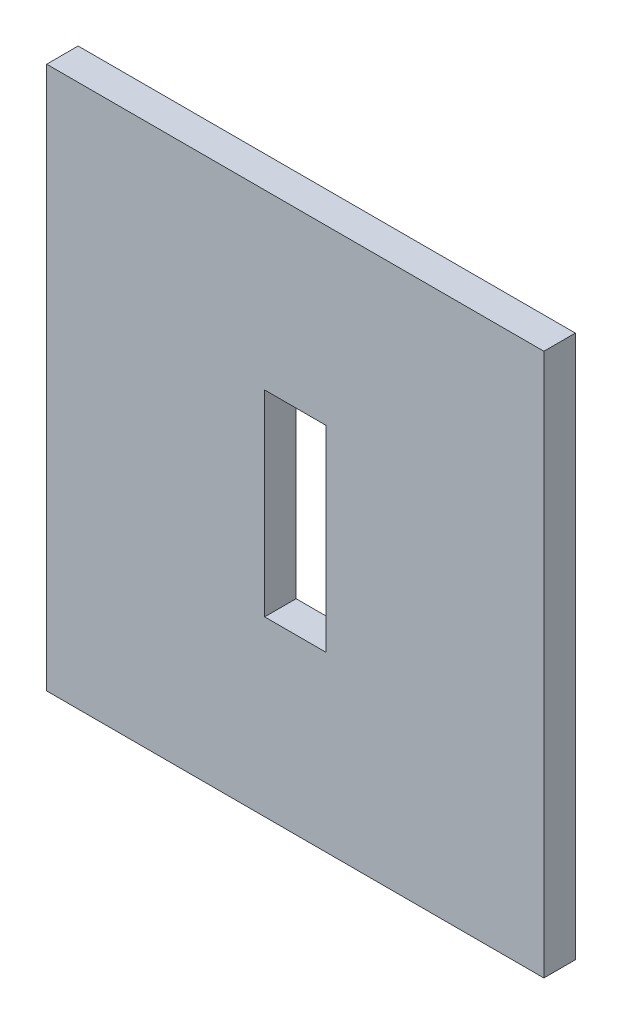
ISO-10303-21;
HEADER;
FILE_DESCRIPTION(('STEP AP214'),'2;1');
FILE_NAME('part.step','',(''),(''),'','','');
FILE_SCHEMA(('AUTOMOTIVE_DESIGN { 1 0 10303 214 1 1 1 1 }'));
ENDSEC;
DATA;
#1=APPLICATION_CONTEXT('core data for automotive mechanical design processes');
#2=APPLICATION_PROTOCOL_DEFINITION('international standard','automotive_design',2000,#1);
#3=PRODUCT_CONTEXT('',#1,'mechanical');
#4=PRODUCT('Part','Part','',(#3));
#5=PRODUCT_RELATED_PRODUCT_CATEGORY('part','',(#4));
#6=PRODUCT_DEFINITION_FORMATION('','',#4);
#7=PRODUCT_DEFINITION_CONTEXT('part definition',#1,'design');
#8=PRODUCT_DEFINITION('design','',#6,#7);
#9=PRODUCT_DEFINITION_SHAPE('','',#8);
#10=(LENGTH_UNIT() NAMED_UNIT(*) SI_UNIT(.MILLI.,.METRE.));
#11=(NAMED_UNIT(*) PLANE_ANGLE_UNIT() SI_UNIT($,.RADIAN.));
#12=(NAMED_UNIT(*) SI_UNIT($,.STERADIAN.) SOLID_ANGLE_UNIT());
#13=UNCERTAINTY_MEASURE_WITH_UNIT(LENGTH_MEASURE(1.E-05),#10,'distance_accuracy_value','');
#14=(GEOMETRIC_REPRESENTATION_CONTEXT(3) GLOBAL_UNCERTAINTY_ASSIGNED_CONTEXT((#13)) GLOBAL_UNIT_ASSIGNED_CONTEXT((#10,
#11,#12)) REPRESENTATION_CONTEXT('',''));
#15=CARTESIAN_POINT('',(0.,0.,0.));
#16=DIRECTION('',(0.,0.,1.));
#17=DIRECTION('',(1.,0.,0.));
#18=AXIS2_PLACEMENT_3D('',#15,#16,#17);
#19=CARTESIAN_POINT('',(25.085,27.385,3.175));
#20=DIRECTION('',(-1.,0.,0.));
#21=DIRECTION('',(0.,-1.,0.));
#22=AXIS2_PLACEMENT_3D('',#19,#20,#21);
#23=PLANE('',#22);
#24=DIRECTION('',(0.,1.,0.));
#25=VECTOR('',#24,1.);
#26=CARTESIAN_POINT('',(25.085,27.385,0.));
#27=LINE('',#26,#25);
#28=CARTESIAN_POINT('',(25.085,-27.385,0.));
#29=VERTEX_POINT('',#28);
#30=CARTESIAN_POINT('',(25.085,27.385,0.));
#31=VERTEX_POINT('',#30);
#32=EDGE_CURVE('E133',#29,#31,#27,.T.);
#33=ORIENTED_EDGE('',*,*,#32,.T.);
#34=DIRECTION('',(0.,0.,-1.));
#35=VECTOR('',#34,1.);
#36=CARTESIAN_POINT('',(25.085,27.385,3.175));
#37=LINE('',#36,#35);
#38=CARTESIAN_POINT('',(25.085,27.385,3.175));
#39=VERTEX_POINT('',#38);
#40=EDGE_CURVE('E11',#39,#31,#37,.T.);
#41=ORIENTED_EDGE('',*,*,#40,.F.);
#42=DIRECTION('',(0.,1.,0.));
#43=VECTOR('',#42,1.);
#44=CARTESIAN_POINT('',(25.085,27.385,3.175));
#45=LINE('',#44,#43);
#46=CARTESIAN_POINT('',(25.085,-27.385,3.175));
#47=VERTEX_POINT('',#46);
#48=EDGE_CURVE('E137',#47,#39,#45,.T.);
#49=ORIENTED_EDGE('',*,*,#48,.F.);
#50=DIRECTION('',(0.,0.,-1.));
#51=VECTOR('',#50,1.);
#52=CARTESIAN_POINT('',(25.085,-27.385,3.175));
#53=LINE('',#52,#51);
#54=EDGE_CURVE('E147',#47,#29,#53,.T.);
#55=ORIENTED_EDGE('',*,*,#54,.T.);
#56=EDGE_LOOP('',(#33,#41,#49,#55));
#57=FACE_BOUND('',#56,.T.);
#58=ADVANCED_FACE('F36',(#57),#23,.F.);
#59=CARTESIAN_POINT('',(-25.085,27.385,3.175));
#60=DIRECTION('',(0.,-1.,0.));
#61=DIRECTION('',(0.,0.,-1.));
#62=AXIS2_PLACEMENT_3D('',#59,#60,#61);
#63=PLANE('',#62);
#64=DIRECTION('',(-1.,0.,0.));
#65=VECTOR('',#64,1.);
#66=CARTESIAN_POINT('',(-25.085,27.385,0.));
#67=LINE('',#66,#65);
#68=CARTESIAN_POINT('',(-25.085,27.385,0.));
#69=VERTEX_POINT('',#68);
#70=EDGE_CURVE('E150',#31,#69,#67,.T.);
#71=ORIENTED_EDGE('',*,*,#70,.T.);
#72=DIRECTION('',(0.,0.,-1.));
#73=VECTOR('',#72,1.);
#74=CARTESIAN_POINT('',(-25.085,27.385,3.175));
#75=LINE('',#74,#73);
#76=CARTESIAN_POINT('',(-25.085,27.385,3.175));
#77=VERTEX_POINT('',#76);
#78=EDGE_CURVE('E43',#77,#69,#75,.T.);
#79=ORIENTED_EDGE('',*,*,#78,.F.);
#80=DIRECTION('',(-1.,0.,0.));
#81=VECTOR('',#80,1.);
#82=CARTESIAN_POINT('',(-25.085,27.385,3.175));
#83=LINE('',#82,#81);
#84=EDGE_CURVE('E140',#39,#77,#83,.T.);
#85=ORIENTED_EDGE('',*,*,#84,.F.);
#86=ORIENTED_EDGE('',*,*,#40,.T.);
#87=EDGE_LOOP('',(#71,#79,#85,#86));
#88=FACE_BOUND('',#87,.T.);
#89=ADVANCED_FACE('F178',(#88),#63,.F.);
#90=CARTESIAN_POINT('',(-25.085,27.385,3.175));
#91=DIRECTION('',(1.,0.,0.));
#92=DIRECTION('',(0.,1.,0.));
#93=AXIS2_PLACEMENT_3D('',#90,#91,#92);
#94=PLANE('',#93);
#95=DIRECTION('',(0.,-1.,0.));
#96=VECTOR('',#95,1.);
#97=CARTESIAN_POINT('',(-25.085,27.385,0.));
#98=LINE('',#97,#96);
#99=CARTESIAN_POINT('',(-25.085,-27.385,0.));
#100=VERTEX_POINT('',#99);
#101=EDGE_CURVE('E152',#69,#100,#98,.T.);
#102=ORIENTED_EDGE('',*,*,#101,.T.);
#103=DIRECTION('',(0.,0.,-1.));
#104=VECTOR('',#103,1.);
#105=CARTESIAN_POINT('',(-25.085,-27.385,3.175));
#106=LINE('',#105,#104);
#107=CARTESIAN_POINT('',(-25.085,-27.385,3.175));
#108=VERTEX_POINT('',#107);
#109=EDGE_CURVE('E157',#108,#100,#106,.T.);
#110=ORIENTED_EDGE('',*,*,#109,.F.);
#111=DIRECTION('',(0.,-1.,0.));
#112=VECTOR('',#111,1.);
#113=CARTESIAN_POINT('',(-25.085,27.385,3.175));
#114=LINE('',#113,#112);
#115=EDGE_CURVE('E143',#77,#108,#114,.T.);
#116=ORIENTED_EDGE('',*,*,#115,.F.);
#117=ORIENTED_EDGE('',*,*,#78,.T.);
#118=EDGE_LOOP('',(#102,#110,#116,#117));
#119=FACE_BOUND('',#118,.T.);
#120=ADVANCED_FACE('F164',(#119),#94,.F.);
#121=CARTESIAN_POINT('',(-25.085,-27.385,3.175));
#122=DIRECTION('',(0.,1.,0.));
#123=DIRECTION('',(0.,0.,1.));
#124=AXIS2_PLACEMENT_3D('',#121,#122,#123);
#125=PLANE('',#124);
#126=DIRECTION('',(1.,0.,0.));
#127=VECTOR('',#126,1.);
#128=CARTESIAN_POINT('',(-25.085,-27.385,0.));
#129=LINE('',#128,#127);
#130=EDGE_CURVE('E141',#100,#29,#129,.T.);
#131=ORIENTED_EDGE('',*,*,#130,.T.);
#132=ORIENTED_EDGE('',*,*,#54,.F.);
#133=DIRECTION('',(1.,0.,0.));
#134=VECTOR('',#133,1.);
#135=CARTESIAN_POINT('',(-25.085,-27.385,3.175));
#136=LINE('',#135,#134);
#137=EDGE_CURVE('E145',#108,#47,#136,.T.);
#138=ORIENTED_EDGE('',*,*,#137,.F.);
#139=ORIENTED_EDGE('',*,*,#109,.T.);
#140=EDGE_LOOP('',(#131,#132,#138,#139));
#141=FACE_BOUND('',#140,.T.);
#142=ADVANCED_FACE('F171',(#141),#125,.F.);
#143=CARTESIAN_POINT('',(0.,0.,3.175));
#144=DIRECTION('',(0.,0.,1.));
#145=DIRECTION('',(1.,0.,0.));
#146=AXIS2_PLACEMENT_3D('',#143,#144,#145);
#147=PLANE('',#146);
#148=DIRECTION('',(0.,1.,0.));
#149=VECTOR('',#148,1.);
#150=CARTESIAN_POINT('',(3.09,9.915,3.175));
#151=LINE('',#150,#149);
#152=CARTESIAN_POINT('',(3.09,-9.915,3.175));
#153=VERTEX_POINT('',#152);
#154=CARTESIAN_POINT('',(3.09,9.915,3.175));
#155=VERTEX_POINT('',#154);
#156=EDGE_CURVE('E50',#153,#155,#151,.T.);
#157=ORIENTED_EDGE('',*,*,#156,.F.);
#158=DIRECTION('',(1.,0.,0.));
#159=VECTOR('',#158,1.);
#160=CARTESIAN_POINT('',(-3.09,-9.915,3.175));
#161=LINE('',#160,#159);
#162=CARTESIAN_POINT('',(-3.09,-9.915,3.175));
#163=VERTEX_POINT('',#162);
#164=EDGE_CURVE('E118',#163,#153,#161,.T.);
#165=ORIENTED_EDGE('',*,*,#164,.F.);
#166=DIRECTION('',(0.,-1.,0.));
#167=VECTOR('',#166,1.);
#168=CARTESIAN_POINT('',(-3.09,9.915,3.175));
#169=LINE('',#168,#167);
#170=CARTESIAN_POINT('',(-3.09,9.915,3.175));
#171=VERTEX_POINT('',#170);
#172=EDGE_CURVE('E121',#171,#163,#169,.T.);
#173=ORIENTED_EDGE('',*,*,#172,.F.);
#174=DIRECTION('',(-1.,0.,0.));
#175=VECTOR('',#174,1.);
#176=CARTESIAN_POINT('',(-3.09,9.915,3.175));
#177=LINE('',#176,#175);
#178=EDGE_CURVE('E127',#155,#171,#177,.T.);
#179=ORIENTED_EDGE('',*,*,#178,.F.);
#180=EDGE_LOOP('',(#157,#165,#173,#179));
#181=FACE_BOUND('',#180,.T.);
#182=ORIENTED_EDGE('',*,*,#48,.T.);
#183=ORIENTED_EDGE('',*,*,#84,.T.);
#184=ORIENTED_EDGE('',*,*,#115,.T.);
#185=ORIENTED_EDGE('',*,*,#137,.T.);
#186=EDGE_LOOP('',(#182,#183,#184,#185));
#187=FACE_BOUND('',#186,.T.);
#188=ADVANCED_FACE('F177',(#181,#187),#147,.T.);
#189=CARTESIAN_POINT('',(0.,0.,0.));
#190=DIRECTION('',(0.,0.,1.));
#191=DIRECTION('',(1.,0.,0.));
#192=AXIS2_PLACEMENT_3D('',#189,#190,#191);
#193=PLANE('',#192);
#194=DIRECTION('',(1.,0.,0.));
#195=VECTOR('',#194,1.);
#196=CARTESIAN_POINT('',(-3.09,-9.915,0.));
#197=LINE('',#196,#195);
#198=CARTESIAN_POINT('',(-3.09,-9.915,0.));
#199=VERTEX_POINT('',#198);
#200=CARTESIAN_POINT('',(3.09,-9.915,0.));
#201=VERTEX_POINT('',#200);
#202=EDGE_CURVE('E108',#199,#201,#197,.T.);
#203=ORIENTED_EDGE('',*,*,#202,.T.);
#204=DIRECTION('',(0.,1.,0.));
#205=VECTOR('',#204,1.);
#206=CARTESIAN_POINT('',(3.09,9.915,0.));
#207=LINE('',#206,#205);
#208=CARTESIAN_POINT('',(3.09,9.915,0.));
#209=VERTEX_POINT('',#208);
#210=EDGE_CURVE('E102',#201,#209,#207,.T.);
#211=ORIENTED_EDGE('',*,*,#210,.T.);
#212=DIRECTION('',(-1.,0.,0.));
#213=VECTOR('',#212,1.);
#214=CARTESIAN_POINT('',(-3.09,9.915,0.));
#215=LINE('',#214,#213);
#216=CARTESIAN_POINT('',(-3.09,9.915,0.));
#217=VERTEX_POINT('',#216);
#218=EDGE_CURVE('E111',#209,#217,#215,.T.);
#219=ORIENTED_EDGE('',*,*,#218,.T.);
#220=DIRECTION('',(0.,-1.,0.));
#221=VECTOR('',#220,1.);
#222=CARTESIAN_POINT('',(-3.09,9.915,0.));
#223=LINE('',#222,#221);
#224=EDGE_CURVE('E58',#217,#199,#223,.T.);
#225=ORIENTED_EDGE('',*,*,#224,.T.);
#226=EDGE_LOOP('',(#203,#211,#219,#225));
#227=FACE_BOUND('',#226,.T.);
#228=ORIENTED_EDGE('',*,*,#32,.F.);
#229=ORIENTED_EDGE('',*,*,#130,.F.);
#230=ORIENTED_EDGE('',*,*,#101,.F.);
#231=ORIENTED_EDGE('',*,*,#70,.F.);
#232=EDGE_LOOP('',(#228,#229,#230,#231));
#233=FACE_BOUND('',#232,.T.);
#234=ADVANCED_FACE('F115',(#227,#233),#193,.F.);
#235=CARTESIAN_POINT('',(3.09,9.915,0.));
#236=DIRECTION('',(1.,0.,0.));
#237=DIRECTION('',(0.,1.,0.));
#238=AXIS2_PLACEMENT_3D('',#235,#236,#237);
#239=PLANE('',#238);
#240=ORIENTED_EDGE('',*,*,#156,.T.);
#241=DIRECTION('',(0.,0.,1.));
#242=VECTOR('',#241,1.);
#243=CARTESIAN_POINT('',(3.09,9.915,0.));
#244=LINE('',#243,#242);
#245=EDGE_CURVE('E98',#209,#155,#244,.T.);
#246=ORIENTED_EDGE('',*,*,#245,.F.);
#247=ORIENTED_EDGE('',*,*,#210,.F.);
#248=DIRECTION('',(0.,0.,1.));
#249=VECTOR('',#248,1.);
#250=CARTESIAN_POINT('',(3.09,-9.915,0.));
#251=LINE('',#250,#249);
#252=EDGE_CURVE('E131',#201,#153,#251,.T.);
#253=ORIENTED_EDGE('',*,*,#252,.T.);
#254=EDGE_LOOP('',(#240,#246,#247,#253));
#255=FACE_BOUND('',#254,.T.);
#256=ADVANCED_FACE('F100',(#255),#239,.F.);
#257=CARTESIAN_POINT('',(-3.09,-9.915,0.));
#258=DIRECTION('',(0.,-1.,0.));
#259=DIRECTION('',(0.,0.,-1.));
#260=AXIS2_PLACEMENT_3D('',#257,#258,#259);
#261=PLANE('',#260);
#262=ORIENTED_EDGE('',*,*,#164,.T.);
#263=ORIENTED_EDGE('',*,*,#252,.F.);
#264=ORIENTED_EDGE('',*,*,#202,.F.);
#265=DIRECTION('',(0.,0.,1.));
#266=VECTOR('',#265,1.);
#267=CARTESIAN_POINT('',(-3.09,-9.915,0.));
#268=LINE('',#267,#266);
#269=EDGE_CURVE('E134',#199,#163,#268,.T.);
#270=ORIENTED_EDGE('',*,*,#269,.T.);
#271=EDGE_LOOP('',(#262,#263,#264,#270));
#272=FACE_BOUND('',#271,.T.);
#273=ADVANCED_FACE('F195',(#272),#261,.F.);
#274=CARTESIAN_POINT('',(-3.09,9.915,0.));
#275=DIRECTION('',(-1.,0.,0.));
#276=DIRECTION('',(0.,-1.,0.));
#277=AXIS2_PLACEMENT_3D('',#274,#275,#276);
#278=PLANE('',#277);
#279=ORIENTED_EDGE('',*,*,#172,.T.);
#280=ORIENTED_EDGE('',*,*,#269,.F.);
#281=ORIENTED_EDGE('',*,*,#224,.F.);
#282=DIRECTION('',(0.,0.,1.));
#283=VECTOR('',#282,1.);
#284=CARTESIAN_POINT('',(-3.09,9.915,0.));
#285=LINE('',#284,#283);
#286=EDGE_CURVE('E107',#217,#171,#285,.T.);
#287=ORIENTED_EDGE('',*,*,#286,.T.);
#288=EDGE_LOOP('',(#279,#280,#281,#287));
#289=FACE_BOUND('',#288,.T.);
#290=ADVANCED_FACE('F198',(#289),#278,.F.);
#291=CARTESIAN_POINT('',(-3.09,9.915,0.));
#292=DIRECTION('',(0.,1.,0.));
#293=DIRECTION('',(0.,0.,1.));
#294=AXIS2_PLACEMENT_3D('',#291,#292,#293);
#295=PLANE('',#294);
#296=ORIENTED_EDGE('',*,*,#178,.T.);
#297=ORIENTED_EDGE('',*,*,#286,.F.);
#298=ORIENTED_EDGE('',*,*,#218,.F.);
#299=ORIENTED_EDGE('',*,*,#245,.T.);
#300=EDGE_LOOP('',(#296,#297,#298,#299));
#301=FACE_BOUND('',#300,.T.);
#302=ADVANCED_FACE('F112',(#301),#295,.F.);
#303=CLOSED_SHELL('',(#58,#89,#120,#142,#188,#234,#256,#273,#290,#302));
#304=MANIFOLD_SOLID_BREP('B2',#303);
#305=ADVANCED_BREP_SHAPE_REPRESENTATION('',(#18,#304),#14);
#306=SHAPE_DEFINITION_REPRESENTATION(#9,#305);
ENDSEC;
END-ISO-10303-21;
